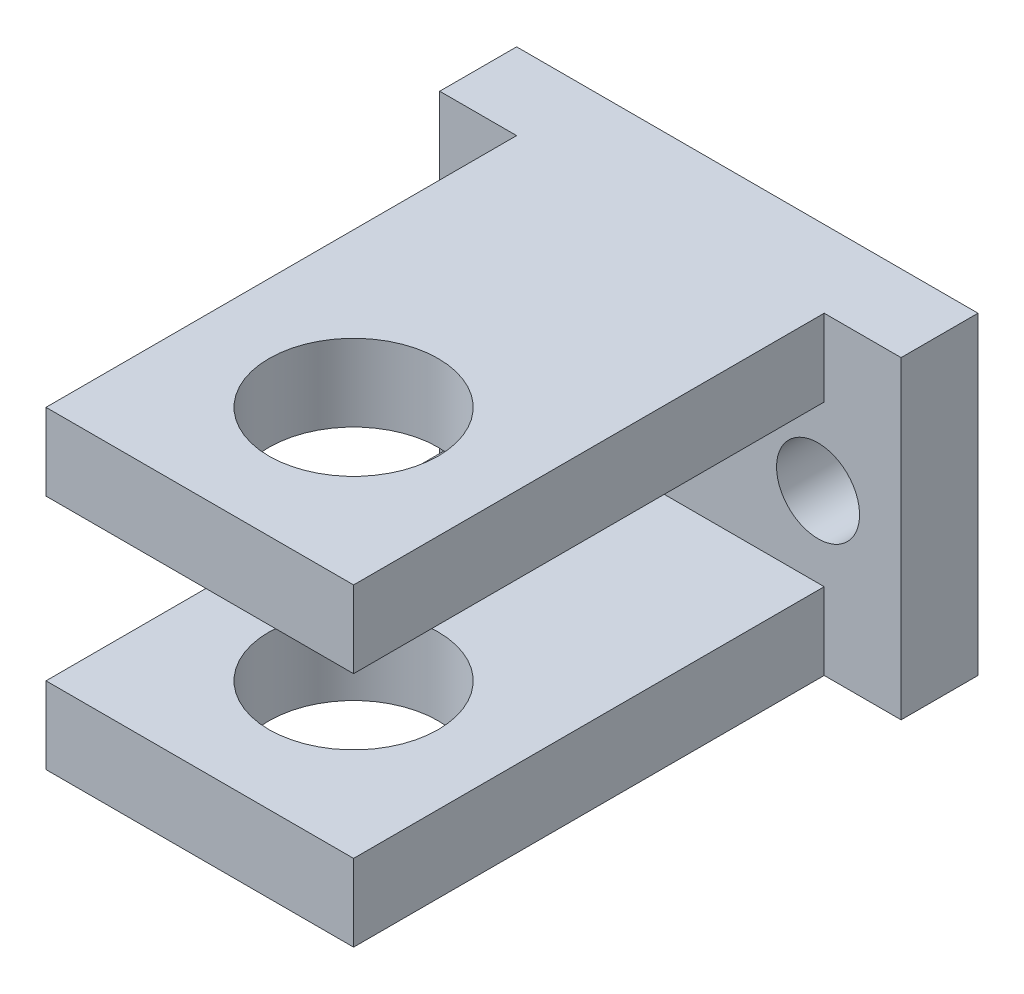
ISO-10303-21;
HEADER;
FILE_DESCRIPTION(('STEP AP214'),'2;1');
FILE_NAME('part.step','',(''),(''),'','','');
FILE_SCHEMA(('AUTOMOTIVE_DESIGN { 1 0 10303 214 1 1 1 1 }'));
ENDSEC;
DATA;
#1=APPLICATION_CONTEXT('core data for automotive mechanical design processes');
#2=APPLICATION_PROTOCOL_DEFINITION('international standard','automotive_design',2000,#1);
#3=PRODUCT_CONTEXT('',#1,'mechanical');
#4=PRODUCT('Part','Part','',(#3));
#5=PRODUCT_RELATED_PRODUCT_CATEGORY('part','',(#4));
#6=PRODUCT_DEFINITION_FORMATION('','',#4);
#7=PRODUCT_DEFINITION_CONTEXT('part definition',#1,'design');
#8=PRODUCT_DEFINITION('design','',#6,#7);
#9=PRODUCT_DEFINITION_SHAPE('','',#8);
#10=(LENGTH_UNIT() NAMED_UNIT(*) SI_UNIT(.MILLI.,.METRE.));
#11=(NAMED_UNIT(*) PLANE_ANGLE_UNIT() SI_UNIT($,.RADIAN.));
#12=(NAMED_UNIT(*) SI_UNIT($,.STERADIAN.) SOLID_ANGLE_UNIT());
#13=UNCERTAINTY_MEASURE_WITH_UNIT(LENGTH_MEASURE(1.E-05),#10,'distance_accuracy_value','');
#14=(GEOMETRIC_REPRESENTATION_CONTEXT(3) GLOBAL_UNCERTAINTY_ASSIGNED_CONTEXT((#13)) GLOBAL_UNIT_ASSIGNED_CONTEXT((#10,
#11,#12)) REPRESENTATION_CONTEXT('',''));
#15=CARTESIAN_POINT('',(0.,0.,0.));
#16=DIRECTION('',(0.,0.,1.));
#17=DIRECTION('',(1.,0.,0.));
#18=AXIS2_PLACEMENT_3D('',#15,#16,#17);
#19=CARTESIAN_POINT('',(-6.35,3.175,11.303));
#20=DIRECTION('',(1.,0.,0.));
#21=DIRECTION('',(0.,0.,-1.));
#22=AXIS2_PLACEMENT_3D('',#19,#20,#21);
#23=PLANE('',#22);
#24=DIRECTION('',(0.,0.,1.));
#25=VECTOR('',#24,1.);
#26=CARTESIAN_POINT('',(-6.35,12.954,-11.303));
#27=LINE('',#26,#25);
#28=CARTESIAN_POINT('',(-6.35,12.954,-8.128));
#29=VERTEX_POINT('',#28);
#30=CARTESIAN_POINT('',(-6.35,12.954,11.303));
#31=VERTEX_POINT('',#30);
#32=EDGE_CURVE('E207',#29,#31,#27,.T.);
#33=ORIENTED_EDGE('',*,*,#32,.F.);
#34=DIRECTION('',(0.,-1.,0.));
#35=VECTOR('',#34,1.);
#36=CARTESIAN_POINT('',(-6.35,0.,-8.128));
#37=LINE('',#36,#35);
#38=CARTESIAN_POINT('',(-6.35,9.779,-8.128));
#39=VERTEX_POINT('',#38);
#40=EDGE_CURVE('E147',#29,#39,#37,.T.);
#41=ORIENTED_EDGE('',*,*,#40,.T.);
#42=DIRECTION('',(0.,0.,1.));
#43=VECTOR('',#42,1.);
#44=CARTESIAN_POINT('',(-6.35,9.779,-11.303));
#45=LINE('',#44,#43);
#46=CARTESIAN_POINT('',(-6.35,9.779,11.303));
#47=VERTEX_POINT('',#46);
#48=EDGE_CURVE('E202',#39,#47,#45,.T.);
#49=ORIENTED_EDGE('',*,*,#48,.T.);
#50=DIRECTION('',(0.,-1.,0.));
#51=VECTOR('',#50,1.);
#52=CARTESIAN_POINT('',(-6.35,12.954,11.303));
#53=LINE('',#52,#51);
#54=EDGE_CURVE('E261',#31,#47,#53,.T.);
#55=ORIENTED_EDGE('',*,*,#54,.F.);
#56=EDGE_LOOP('',(#33,#41,#49,#55));
#57=FACE_BOUND('',#56,.T.);
#58=ADVANCED_FACE('F35',(#57),#23,.F.);
#59=CARTESIAN_POINT('',(6.35,3.175,11.303));
#60=DIRECTION('',(-1.,0.,0.));
#61=DIRECTION('',(0.,0.,1.));
#62=AXIS2_PLACEMENT_3D('',#59,#60,#61);
#63=PLANE('',#62);
#64=DIRECTION('',(0.,0.,-1.));
#65=VECTOR('',#64,1.);
#66=CARTESIAN_POINT('',(6.35,0.,11.303));
#67=LINE('',#66,#65);
#68=CARTESIAN_POINT('',(6.35,0.,11.303));
#69=VERTEX_POINT('',#68);
#70=CARTESIAN_POINT('',(6.35,0.,-8.128));
#71=VERTEX_POINT('',#70);
#72=EDGE_CURVE('E243',#69,#71,#67,.T.);
#73=ORIENTED_EDGE('',*,*,#72,.T.);
#74=DIRECTION('',(0.,1.,0.));
#75=VECTOR('',#74,1.);
#76=CARTESIAN_POINT('',(6.35,0.,-8.128));
#77=LINE('',#76,#75);
#78=CARTESIAN_POINT('',(6.35,3.175,-8.128));
#79=VERTEX_POINT('',#78);
#80=EDGE_CURVE('E183',#71,#79,#77,.T.);
#81=ORIENTED_EDGE('',*,*,#80,.T.);
#82=DIRECTION('',(0.,0.,-1.));
#83=VECTOR('',#82,1.);
#84=CARTESIAN_POINT('',(6.35,3.175,11.303));
#85=LINE('',#84,#83);
#86=CARTESIAN_POINT('',(6.35,3.175,11.303));
#87=VERTEX_POINT('',#86);
#88=EDGE_CURVE('E221',#87,#79,#85,.T.);
#89=ORIENTED_EDGE('',*,*,#88,.F.);
#90=DIRECTION('',(0.,-1.,0.));
#91=VECTOR('',#90,1.);
#92=CARTESIAN_POINT('',(6.35,3.175,11.303));
#93=LINE('',#92,#91);
#94=EDGE_CURVE('E222',#87,#69,#93,.T.);
#95=ORIENTED_EDGE('',*,*,#94,.T.);
#96=EDGE_LOOP('',(#73,#81,#89,#95));
#97=FACE_BOUND('',#96,.T.);
#98=ADVANCED_FACE('F301',(#97),#63,.F.);
#99=CARTESIAN_POINT('',(6.35,3.175,-11.303));
#100=DIRECTION('',(0.,-1.,0.));
#101=DIRECTION('',(0.,0.,-1.));
#102=AXIS2_PLACEMENT_3D('',#99,#100,#101);
#103=PLANE('',#102);
#104=CARTESIAN_POINT('',(0.,3.175,4.953));
#105=DIRECTION('',(0.,-1.,0.));
#106=DIRECTION('',(0.,0.,-1.));
#107=AXIS2_PLACEMENT_3D('',#104,#105,#106);
#108=CIRCLE('',#107,3.4925);
#109=CARTESIAN_POINT('',(0.,3.175,1.4605));
#110=VERTEX_POINT('',#109);
#111=EDGE_CURVE('E199',#110,#110,#108,.T.);
#112=ORIENTED_EDGE('',*,*,#111,.T.);
#113=EDGE_LOOP('',(#112));
#114=FACE_BOUND('',#113,.T.);
#115=DIRECTION('',(1.,0.,0.));
#116=VECTOR('',#115,1.);
#117=CARTESIAN_POINT('',(-6.35,3.175,-8.128));
#118=LINE('',#117,#116);
#119=CARTESIAN_POINT('',(-6.35,3.175,-8.128));
#120=VERTEX_POINT('',#119);
#121=EDGE_CURVE('E272',#120,#79,#118,.T.);
#122=ORIENTED_EDGE('',*,*,#121,.F.);
#123=DIRECTION('',(0.,0.,1.));
#124=VECTOR('',#123,1.);
#125=CARTESIAN_POINT('',(-6.35,3.175,11.303));
#126=LINE('',#125,#124);
#127=CARTESIAN_POINT('',(-6.35,3.175,11.303));
#128=VERTEX_POINT('',#127);
#129=EDGE_CURVE('E232',#120,#128,#126,.T.);
#130=ORIENTED_EDGE('',*,*,#129,.T.);
#131=DIRECTION('',(1.,0.,0.));
#132=VECTOR('',#131,1.);
#133=CARTESIAN_POINT('',(-6.35,3.175,11.303));
#134=LINE('',#133,#132);
#135=EDGE_CURVE('E226',#128,#87,#134,.T.);
#136=ORIENTED_EDGE('',*,*,#135,.T.);
#137=ORIENTED_EDGE('',*,*,#88,.T.);
#138=EDGE_LOOP('',(#122,#130,#136,#137));
#139=FACE_BOUND('',#138,.T.);
#140=ADVANCED_FACE('F308',(#114,#139),#103,.F.);
#141=DIRECTION('',(0.,0.,-1.));
#142=VECTOR('',#141,1.);
#143=CARTESIAN_POINT('',(6.35,9.779,-11.303));
#144=LINE('',#143,#142);
#145=CARTESIAN_POINT('',(6.35,9.779,11.303));
#146=VERTEX_POINT('',#145);
#147=CARTESIAN_POINT('',(6.35,9.779,-8.128));
#148=VERTEX_POINT('',#147);
#149=EDGE_CURVE('E209',#146,#148,#144,.T.);
#150=ORIENTED_EDGE('',*,*,#149,.T.);
#151=CARTESIAN_POINT('',(6.35,12.954,-8.128));
#152=VERTEX_POINT('',#151);
#153=EDGE_CURVE('E44',#148,#152,#77,.T.);
#154=ORIENTED_EDGE('',*,*,#153,.T.);
#155=DIRECTION('',(0.,0.,-1.));
#156=VECTOR('',#155,1.);
#157=CARTESIAN_POINT('',(6.35,12.954,-11.303));
#158=LINE('',#157,#156);
#159=CARTESIAN_POINT('',(6.35,12.954,11.303));
#160=VERTEX_POINT('',#159);
#161=EDGE_CURVE('E247',#160,#152,#158,.T.);
#162=ORIENTED_EDGE('',*,*,#161,.F.);
#163=DIRECTION('',(0.,-1.,0.));
#164=VECTOR('',#163,1.);
#165=CARTESIAN_POINT('',(6.35,12.954,11.303));
#166=LINE('',#165,#164);
#167=EDGE_CURVE('E253',#160,#146,#166,.T.);
#168=ORIENTED_EDGE('',*,*,#167,.T.);
#169=EDGE_LOOP('',(#150,#154,#162,#168));
#170=FACE_BOUND('',#169,.T.);
#171=ADVANCED_FACE('F37',(#170),#63,.F.);
#172=CARTESIAN_POINT('',(-6.35,3.175,-11.303));
#173=DIRECTION('',(0.,0.,1.));
#174=DIRECTION('',(1.,0.,0.));
#175=AXIS2_PLACEMENT_3D('',#172,#173,#174);
#176=PLANE('',#175);
#177=CARTESIAN_POINT('',(6.096,6.477,-11.303));
#178=DIRECTION('',(0.,0.,-1.));
#179=DIRECTION('',(-1.,0.,0.));
#180=AXIS2_PLACEMENT_3D('',#177,#178,#179);
#181=CIRCLE('',#180,1.7145);
#182=CARTESIAN_POINT('',(4.3815,6.477,-11.303));
#183=VERTEX_POINT('',#182);
#184=EDGE_CURVE('E168',#183,#183,#181,.T.);
#185=ORIENTED_EDGE('',*,*,#184,.F.);
#186=EDGE_LOOP('',(#185));
#187=FACE_BOUND('',#186,.T.);
#188=CARTESIAN_POINT('',(-6.096,6.477,-11.303));
#189=DIRECTION('',(0.,0.,-1.));
#190=DIRECTION('',(-1.,0.,0.));
#191=AXIS2_PLACEMENT_3D('',#188,#189,#190);
#192=CIRCLE('',#191,1.7145);
#193=CARTESIAN_POINT('',(-7.8105,6.477,-11.303));
#194=VERTEX_POINT('',#193);
#195=EDGE_CURVE('E159',#194,#194,#192,.T.);
#196=ORIENTED_EDGE('',*,*,#195,.F.);
#197=EDGE_LOOP('',(#196));
#198=FACE_BOUND('',#197,.T.);
#199=DIRECTION('',(-1.,0.,0.));
#200=VECTOR('',#199,1.);
#201=CARTESIAN_POINT('',(-6.35,0.,-11.303));
#202=LINE('',#201,#200);
#203=CARTESIAN_POINT('',(9.52499999999999,0.,-11.303));
#204=VERTEX_POINT('',#203);
#205=CARTESIAN_POINT('',(-9.525,0.,-11.303));
#206=VERTEX_POINT('',#205);
#207=EDGE_CURVE('E213',#204,#206,#202,.T.);
#208=ORIENTED_EDGE('',*,*,#207,.T.);
#209=DIRECTION('',(0.,1.,0.));
#210=VECTOR('',#209,1.);
#211=CARTESIAN_POINT('',(-9.525,12.954,-11.303));
#212=LINE('',#211,#210);
#213=CARTESIAN_POINT('',(-9.525,12.954,-11.303));
#214=VERTEX_POINT('',#213);
#215=EDGE_CURVE('E133',#206,#214,#212,.T.);
#216=ORIENTED_EDGE('',*,*,#215,.T.);
#217=DIRECTION('',(-1.,0.,0.));
#218=VECTOR('',#217,1.);
#219=CARTESIAN_POINT('',(-6.35,12.954,-11.303));
#220=LINE('',#219,#218);
#221=CARTESIAN_POINT('',(9.525,12.954,-11.303));
#222=VERTEX_POINT('',#221);
#223=EDGE_CURVE('E249',#222,#214,#220,.T.);
#224=ORIENTED_EDGE('',*,*,#223,.F.);
#225=DIRECTION('',(0.,-1.,0.));
#226=VECTOR('',#225,1.);
#227=CARTESIAN_POINT('',(9.525,12.954,-11.303));
#228=LINE('',#227,#226);
#229=EDGE_CURVE('E186',#222,#204,#228,.T.);
#230=ORIENTED_EDGE('',*,*,#229,.T.);
#231=EDGE_LOOP('',(#208,#216,#224,#230));
#232=FACE_BOUND('',#231,.T.);
#233=ADVANCED_FACE('F313',(#187,#198,#232),#176,.F.);
#234=ORIENTED_EDGE('',*,*,#129,.F.);
#235=CARTESIAN_POINT('',(-6.35,0.,-8.12799999999999));
#236=VERTEX_POINT('',#235);
#237=EDGE_CURVE('E12',#120,#236,#37,.T.);
#238=ORIENTED_EDGE('',*,*,#237,.T.);
#239=DIRECTION('',(0.,0.,1.));
#240=VECTOR('',#239,1.);
#241=CARTESIAN_POINT('',(-6.35,0.,11.303));
#242=LINE('',#241,#240);
#243=CARTESIAN_POINT('',(-6.35,0.,11.303));
#244=VERTEX_POINT('',#243);
#245=EDGE_CURVE('E146',#236,#244,#242,.T.);
#246=ORIENTED_EDGE('',*,*,#245,.T.);
#247=DIRECTION('',(0.,-1.,0.));
#248=VECTOR('',#247,1.);
#249=CARTESIAN_POINT('',(-6.35,3.175,11.303));
#250=LINE('',#249,#248);
#251=EDGE_CURVE('E225',#128,#244,#250,.T.);
#252=ORIENTED_EDGE('',*,*,#251,.F.);
#253=EDGE_LOOP('',(#234,#238,#246,#252));
#254=FACE_BOUND('',#253,.T.);
#255=ADVANCED_FACE('F304',(#254),#23,.F.);
#256=CARTESIAN_POINT('',(-6.35,3.175,11.303));
#257=DIRECTION('',(0.,0.,-1.));
#258=DIRECTION('',(-1.,0.,0.));
#259=AXIS2_PLACEMENT_3D('',#256,#257,#258);
#260=PLANE('',#259);
#261=DIRECTION('',(1.,0.,0.));
#262=VECTOR('',#261,1.);
#263=CARTESIAN_POINT('',(-6.35,0.,11.303));
#264=LINE('',#263,#262);
#265=EDGE_CURVE('E212',#244,#69,#264,.T.);
#266=ORIENTED_EDGE('',*,*,#265,.T.);
#267=ORIENTED_EDGE('',*,*,#94,.F.);
#268=ORIENTED_EDGE('',*,*,#135,.F.);
#269=ORIENTED_EDGE('',*,*,#251,.T.);
#270=EDGE_LOOP('',(#266,#267,#268,#269));
#271=FACE_BOUND('',#270,.T.);
#272=ADVANCED_FACE('F312',(#271),#260,.F.);
#273=CARTESIAN_POINT('',(6.35,0.,-11.303));
#274=DIRECTION('',(0.,-1.,0.));
#275=DIRECTION('',(0.,0.,-1.));
#276=AXIS2_PLACEMENT_3D('',#273,#274,#275);
#277=PLANE('',#276);
#278=CARTESIAN_POINT('',(0.,0.,4.953));
#279=DIRECTION('',(0.,1.,0.));
#280=DIRECTION('',(0.,0.,1.));
#281=AXIS2_PLACEMENT_3D('',#278,#279,#280);
#282=CIRCLE('',#281,3.4925);
#283=CARTESIAN_POINT('',(0.,0.,8.4455));
#284=VERTEX_POINT('',#283);
#285=EDGE_CURVE('E189',#284,#284,#282,.T.);
#286=ORIENTED_EDGE('',*,*,#285,.T.);
#287=EDGE_LOOP('',(#286));
#288=FACE_BOUND('',#287,.T.);
#289=ORIENTED_EDGE('',*,*,#72,.F.);
#290=ORIENTED_EDGE('',*,*,#265,.F.);
#291=ORIENTED_EDGE('',*,*,#245,.F.);
#292=DIRECTION('',(-1.,0.,0.));
#293=VECTOR('',#292,1.);
#294=CARTESIAN_POINT('',(-9.525,0.,-8.128));
#295=LINE('',#294,#293);
#296=CARTESIAN_POINT('',(-9.525,0.,-8.128));
#297=VERTEX_POINT('',#296);
#298=EDGE_CURVE('E52',#236,#297,#295,.T.);
#299=ORIENTED_EDGE('',*,*,#298,.T.);
#300=DIRECTION('',(0.,0.,-1.));
#301=VECTOR('',#300,1.);
#302=CARTESIAN_POINT('',(-9.525,0.,-8.128));
#303=LINE('',#302,#301);
#304=EDGE_CURVE('E127',#297,#206,#303,.T.);
#305=ORIENTED_EDGE('',*,*,#304,.T.);
#306=ORIENTED_EDGE('',*,*,#207,.F.);
#307=DIRECTION('',(0.,0.,-1.));
#308=VECTOR('',#307,1.);
#309=CARTESIAN_POINT('',(9.52499999999999,0.,-8.128));
#310=LINE('',#309,#308);
#311=CARTESIAN_POINT('',(9.52499999999999,0.,-8.128));
#312=VERTEX_POINT('',#311);
#313=EDGE_CURVE('E196',#312,#204,#310,.T.);
#314=ORIENTED_EDGE('',*,*,#313,.F.);
#315=DIRECTION('',(-1.,0.,0.));
#316=VECTOR('',#315,1.);
#317=CARTESIAN_POINT('',(9.52499999999999,0.,-8.128));
#318=LINE('',#317,#316);
#319=EDGE_CURVE('E329',#312,#71,#318,.T.);
#320=ORIENTED_EDGE('',*,*,#319,.T.);
#321=EDGE_LOOP('',(#289,#290,#291,#299,#305,#306,#314,#320));
#322=FACE_BOUND('',#321,.T.);
#323=ADVANCED_FACE('F144',(#288,#322),#277,.T.);
#324=CARTESIAN_POINT('',(-6.35,9.779,-8.128));
#325=DIRECTION('',(0.,0.,-1.));
#326=DIRECTION('',(-1.,0.,0.));
#327=AXIS2_PLACEMENT_3D('',#324,#325,#326);
#328=PLANE('',#327);
#329=CARTESIAN_POINT('',(6.096,6.477,-8.128));
#330=DIRECTION('',(0.,0.,-1.));
#331=DIRECTION('',(-1.,0.,0.));
#332=AXIS2_PLACEMENT_3D('',#329,#330,#331);
#333=CIRCLE('',#332,1.7145);
#334=CARTESIAN_POINT('',(4.3815,6.477,-8.128));
#335=VERTEX_POINT('',#334);
#336=EDGE_CURVE('E39',#335,#335,#333,.T.);
#337=ORIENTED_EDGE('',*,*,#336,.T.);
#338=EDGE_LOOP('',(#337));
#339=FACE_BOUND('',#338,.T.);
#340=CARTESIAN_POINT('',(-6.096,6.477,-8.128));
#341=DIRECTION('',(0.,0.,-1.));
#342=DIRECTION('',(-1.,0.,0.));
#343=AXIS2_PLACEMENT_3D('',#340,#341,#342);
#344=CIRCLE('',#343,1.7145);
#345=CARTESIAN_POINT('',(-7.8105,6.477,-8.128));
#346=VERTEX_POINT('',#345);
#347=EDGE_CURVE('E157',#346,#346,#344,.T.);
#348=ORIENTED_EDGE('',*,*,#347,.T.);
#349=EDGE_LOOP('',(#348));
#350=FACE_BOUND('',#349,.T.);
#351=ORIENTED_EDGE('',*,*,#121,.T.);
#352=ORIENTED_EDGE('',*,*,#80,.F.);
#353=ORIENTED_EDGE('',*,*,#319,.F.);
#354=DIRECTION('',(0.,-1.,0.));
#355=VECTOR('',#354,1.);
#356=CARTESIAN_POINT('',(9.525,12.954,-8.128));
#357=LINE('',#356,#355);
#358=CARTESIAN_POINT('',(9.525,12.954,-8.128));
#359=VERTEX_POINT('',#358);
#360=EDGE_CURVE('E176',#359,#312,#357,.T.);
#361=ORIENTED_EDGE('',*,*,#360,.F.);
#362=DIRECTION('',(1.,0.,0.));
#363=VECTOR('',#362,1.);
#364=CARTESIAN_POINT('',(6.35,12.954,-8.128));
#365=LINE('',#364,#363);
#366=EDGE_CURVE('E58',#152,#359,#365,.T.);
#367=ORIENTED_EDGE('',*,*,#366,.F.);
#368=ORIENTED_EDGE('',*,*,#153,.F.);
#369=DIRECTION('',(1.,0.,0.));
#370=VECTOR('',#369,1.);
#371=CARTESIAN_POINT('',(-6.35,9.779,-8.128));
#372=LINE('',#371,#370);
#373=EDGE_CURVE('E246',#39,#148,#372,.T.);
#374=ORIENTED_EDGE('',*,*,#373,.F.);
#375=ORIENTED_EDGE('',*,*,#40,.F.);
#376=DIRECTION('',(1.,0.,0.));
#377=VECTOR('',#376,1.);
#378=CARTESIAN_POINT('',(-6.35,12.954,-8.128));
#379=LINE('',#378,#377);
#380=CARTESIAN_POINT('',(-9.525,12.954,-8.128));
#381=VERTEX_POINT('',#380);
#382=EDGE_CURVE('E136',#381,#29,#379,.T.);
#383=ORIENTED_EDGE('',*,*,#382,.F.);
#384=DIRECTION('',(0.,1.,0.));
#385=VECTOR('',#384,1.);
#386=CARTESIAN_POINT('',(-9.525,12.954,-8.128));
#387=LINE('',#386,#385);
#388=EDGE_CURVE('E130',#297,#381,#387,.T.);
#389=ORIENTED_EDGE('',*,*,#388,.F.);
#390=ORIENTED_EDGE('',*,*,#298,.F.);
#391=ORIENTED_EDGE('',*,*,#237,.F.);
#392=EDGE_LOOP('',(#351,#352,#353,#361,#367,#368,#374,#375,#383,#389,#390,#391));
#393=FACE_BOUND('',#392,.T.);
#394=ADVANCED_FACE('F139',(#339,#350,#393),#328,.F.);
#395=CARTESIAN_POINT('',(-6.35,9.779,11.303));
#396=DIRECTION('',(0.,1.,0.));
#397=DIRECTION('',(0.,0.,1.));
#398=AXIS2_PLACEMENT_3D('',#395,#396,#397);
#399=PLANE('',#398);
#400=CARTESIAN_POINT('',(0.,9.779,4.953));
#401=DIRECTION('',(0.,1.,0.));
#402=DIRECTION('',(0.,0.,1.));
#403=AXIS2_PLACEMENT_3D('',#400,#401,#402);
#404=CIRCLE('',#403,3.4925);
#405=CARTESIAN_POINT('',(0.,9.779,8.4455));
#406=VERTEX_POINT('',#405);
#407=EDGE_CURVE('E192',#406,#406,#404,.T.);
#408=ORIENTED_EDGE('',*,*,#407,.T.);
#409=EDGE_LOOP('',(#408));
#410=FACE_BOUND('',#409,.T.);
#411=ORIENTED_EDGE('',*,*,#48,.F.);
#412=ORIENTED_EDGE('',*,*,#373,.T.);
#413=ORIENTED_EDGE('',*,*,#149,.F.);
#414=DIRECTION('',(1.,0.,0.));
#415=VECTOR('',#414,1.);
#416=CARTESIAN_POINT('',(-6.35,9.779,11.303));
#417=LINE('',#416,#415);
#418=EDGE_CURVE('E256',#47,#146,#417,.T.);
#419=ORIENTED_EDGE('',*,*,#418,.F.);
#420=EDGE_LOOP('',(#411,#412,#413,#419));
#421=FACE_BOUND('',#420,.T.);
#422=ADVANCED_FACE('F281',(#410,#421),#399,.F.);
#423=CARTESIAN_POINT('',(-6.35,12.954,11.303));
#424=DIRECTION('',(0.,0.,-1.));
#425=DIRECTION('',(-1.,0.,0.));
#426=AXIS2_PLACEMENT_3D('',#423,#424,#425);
#427=PLANE('',#426);
#428=ORIENTED_EDGE('',*,*,#418,.T.);
#429=ORIENTED_EDGE('',*,*,#167,.F.);
#430=DIRECTION('',(1.,0.,0.));
#431=VECTOR('',#430,1.);
#432=CARTESIAN_POINT('',(-6.35,12.954,11.303));
#433=LINE('',#432,#431);
#434=EDGE_CURVE('E205',#31,#160,#433,.T.);
#435=ORIENTED_EDGE('',*,*,#434,.F.);
#436=ORIENTED_EDGE('',*,*,#54,.T.);
#437=EDGE_LOOP('',(#428,#429,#435,#436));
#438=FACE_BOUND('',#437,.T.);
#439=ADVANCED_FACE('F287',(#438),#427,.F.);
#440=CARTESIAN_POINT('',(-6.35,12.954,11.303));
#441=DIRECTION('',(0.,1.,0.));
#442=DIRECTION('',(0.,0.,1.));
#443=AXIS2_PLACEMENT_3D('',#440,#441,#442);
#444=PLANE('',#443);
#445=CARTESIAN_POINT('',(0.,12.954,4.953));
#446=DIRECTION('',(0.,1.,0.));
#447=DIRECTION('',(0.,0.,1.));
#448=AXIS2_PLACEMENT_3D('',#445,#446,#447);
#449=CIRCLE('',#448,3.4925);
#450=CARTESIAN_POINT('',(0.,12.954,8.4455));
#451=VERTEX_POINT('',#450);
#452=EDGE_CURVE('E193',#451,#451,#449,.T.);
#453=ORIENTED_EDGE('',*,*,#452,.F.);
#454=EDGE_LOOP('',(#453));
#455=FACE_BOUND('',#454,.T.);
#456=ORIENTED_EDGE('',*,*,#223,.T.);
#457=DIRECTION('',(0.,0.,-1.));
#458=VECTOR('',#457,1.);
#459=CARTESIAN_POINT('',(-9.525,12.954,-8.128));
#460=LINE('',#459,#458);
#461=EDGE_CURVE('E135',#381,#214,#460,.T.);
#462=ORIENTED_EDGE('',*,*,#461,.F.);
#463=ORIENTED_EDGE('',*,*,#382,.T.);
#464=ORIENTED_EDGE('',*,*,#32,.T.);
#465=ORIENTED_EDGE('',*,*,#434,.T.);
#466=ORIENTED_EDGE('',*,*,#161,.T.);
#467=ORIENTED_EDGE('',*,*,#366,.T.);
#468=DIRECTION('',(0.,0.,-1.));
#469=VECTOR('',#468,1.);
#470=CARTESIAN_POINT('',(9.525,12.954,-8.128));
#471=LINE('',#470,#469);
#472=EDGE_CURVE('E187',#359,#222,#471,.T.);
#473=ORIENTED_EDGE('',*,*,#472,.T.);
#474=EDGE_LOOP('',(#456,#462,#463,#464,#465,#466,#467,#473));
#475=FACE_BOUND('',#474,.T.);
#476=ADVANCED_FACE('F284',(#455,#475),#444,.T.);
#477=CARTESIAN_POINT('',(0.,0.,4.953));
#478=DIRECTION('',(0.,1.,0.));
#479=DIRECTION('',(0.,0.,1.));
#480=AXIS2_PLACEMENT_3D('',#477,#478,#479);
#481=CYLINDRICAL_SURFACE('',#480,3.4925);
#482=ORIENTED_EDGE('',*,*,#452,.T.);
#483=EDGE_LOOP('',(#482));
#484=FACE_BOUND('',#483,.T.);
#485=ORIENTED_EDGE('',*,*,#407,.F.);
#486=EDGE_LOOP('',(#485));
#487=FACE_BOUND('',#486,.T.);
#488=ADVANCED_FACE('F294',(#484,#487),#481,.F.);
#489=ORIENTED_EDGE('',*,*,#285,.F.);
#490=EDGE_LOOP('',(#489));
#491=FACE_BOUND('',#490,.T.);
#492=ORIENTED_EDGE('',*,*,#111,.F.);
#493=EDGE_LOOP('',(#492));
#494=FACE_BOUND('',#493,.T.);
#495=ADVANCED_FACE('F340',(#491,#494),#481,.F.);
#496=CARTESIAN_POINT('',(9.525,12.954,-8.128));
#497=DIRECTION('',(1.,0.,0.));
#498=DIRECTION('',(0.,1.,0.));
#499=AXIS2_PLACEMENT_3D('',#496,#497,#498);
#500=PLANE('',#499);
#501=ORIENTED_EDGE('',*,*,#229,.F.);
#502=ORIENTED_EDGE('',*,*,#472,.F.);
#503=ORIENTED_EDGE('',*,*,#360,.T.);
#504=ORIENTED_EDGE('',*,*,#313,.T.);
#505=EDGE_LOOP('',(#501,#502,#503,#504));
#506=FACE_BOUND('',#505,.T.);
#507=ADVANCED_FACE('F336',(#506),#500,.T.);
#508=CARTESIAN_POINT('',(-9.525,12.954,-8.128));
#509=DIRECTION('',(-1.,0.,0.));
#510=DIRECTION('',(0.,-1.,0.));
#511=AXIS2_PLACEMENT_3D('',#508,#509,#510);
#512=PLANE('',#511);
#513=ORIENTED_EDGE('',*,*,#215,.F.);
#514=ORIENTED_EDGE('',*,*,#304,.F.);
#515=ORIENTED_EDGE('',*,*,#388,.T.);
#516=ORIENTED_EDGE('',*,*,#461,.T.);
#517=EDGE_LOOP('',(#513,#514,#515,#516));
#518=FACE_BOUND('',#517,.T.);
#519=ADVANCED_FACE('F128',(#518),#512,.T.);
#520=CARTESIAN_POINT('',(-6.096,6.477,11.303025));
#521=DIRECTION('',(0.,0.,-1.));
#522=DIRECTION('',(-1.,0.,0.));
#523=AXIS2_PLACEMENT_3D('',#520,#521,#522);
#524=CYLINDRICAL_SURFACE('',#523,1.7145);
#525=ORIENTED_EDGE('',*,*,#195,.T.);
#526=EDGE_LOOP('',(#525));
#527=FACE_BOUND('',#526,.T.);
#528=ORIENTED_EDGE('',*,*,#347,.F.);
#529=EDGE_LOOP('',(#528));
#530=FACE_BOUND('',#529,.T.);
#531=ADVANCED_FACE('F346',(#527,#530),#524,.F.);
#532=CARTESIAN_POINT('',(6.096,6.477,11.303025));
#533=DIRECTION('',(0.,0.,-1.));
#534=DIRECTION('',(-1.,0.,0.));
#535=AXIS2_PLACEMENT_3D('',#532,#533,#534);
#536=CYLINDRICAL_SURFACE('',#535,1.7145);
#537=ORIENTED_EDGE('',*,*,#184,.T.);
#538=EDGE_LOOP('',(#537));
#539=FACE_BOUND('',#538,.T.);
#540=ORIENTED_EDGE('',*,*,#336,.F.);
#541=EDGE_LOOP('',(#540));
#542=FACE_BOUND('',#541,.T.);
#543=ADVANCED_FACE('F353',(#539,#542),#536,.F.);
#544=CLOSED_SHELL('',(#58,#98,#140,#171,#233,#255,#272,#323,#394,#422,#439,#476,#488,#495,#507,
#519,#531,#543));
#545=MANIFOLD_SOLID_BREP('B2',#544);
#546=ADVANCED_BREP_SHAPE_REPRESENTATION('',(#18,#545),#14);
#547=SHAPE_DEFINITION_REPRESENTATION(#9,#546);
ENDSEC;
END-ISO-10303-21;
